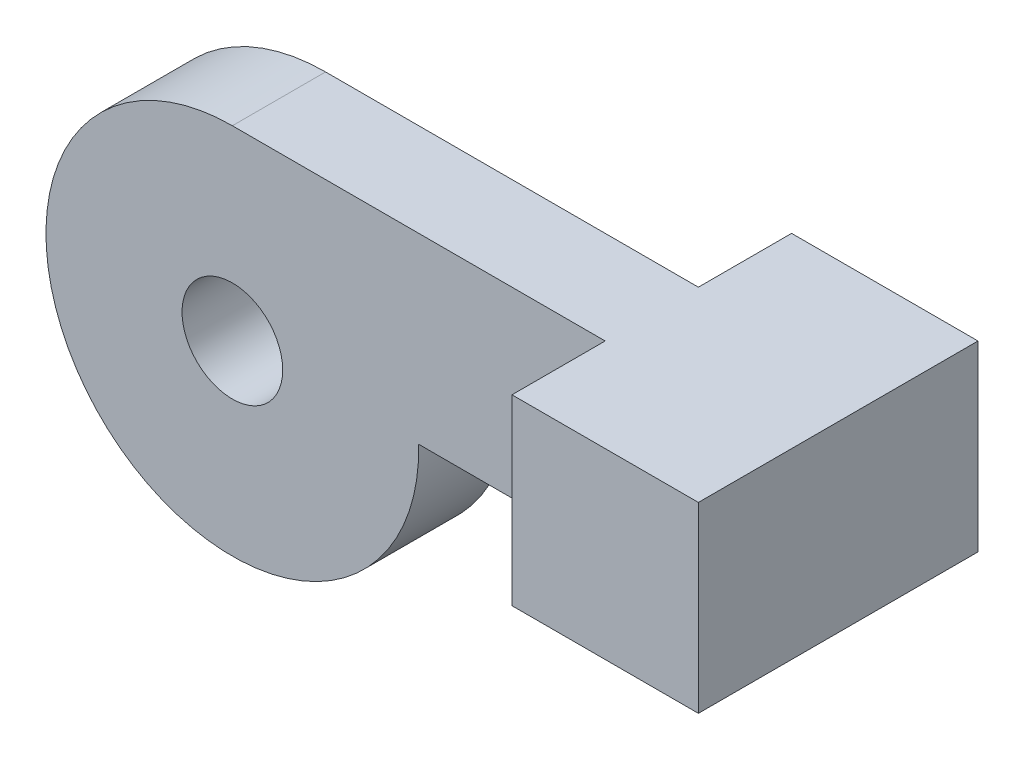
ISO-10303-21;
HEADER;
FILE_DESCRIPTION(('STEP AP214'),'2;1');
FILE_NAME('part.step','',(''),(''),'','','');
FILE_SCHEMA(('AUTOMOTIVE_DESIGN { 1 0 10303 214 1 1 1 1 }'));
ENDSEC;
DATA;
#1=APPLICATION_CONTEXT('core data for automotive mechanical design processes');
#2=APPLICATION_PROTOCOL_DEFINITION('international standard','automotive_design',2000,#1);
#3=PRODUCT_CONTEXT('',#1,'mechanical');
#4=PRODUCT('Part','Part','',(#3));
#5=PRODUCT_RELATED_PRODUCT_CATEGORY('part','',(#4));
#6=PRODUCT_DEFINITION_FORMATION('','',#4);
#7=PRODUCT_DEFINITION_CONTEXT('part definition',#1,'design');
#8=PRODUCT_DEFINITION('design','',#6,#7);
#9=PRODUCT_DEFINITION_SHAPE('','',#8);
#10=(LENGTH_UNIT() NAMED_UNIT(*) SI_UNIT(.MILLI.,.METRE.));
#11=(NAMED_UNIT(*) PLANE_ANGLE_UNIT() SI_UNIT($,.RADIAN.));
#12=(NAMED_UNIT(*) SI_UNIT($,.STERADIAN.) SOLID_ANGLE_UNIT());
#13=UNCERTAINTY_MEASURE_WITH_UNIT(LENGTH_MEASURE(1.E-05),#10,'distance_accuracy_value','');
#14=(GEOMETRIC_REPRESENTATION_CONTEXT(3) GLOBAL_UNCERTAINTY_ASSIGNED_CONTEXT((#13)) GLOBAL_UNIT_ASSIGNED_CONTEXT((#10,
#11,#12)) REPRESENTATION_CONTEXT('',''));
#15=CARTESIAN_POINT('',(0.,0.,0.));
#16=DIRECTION('',(0.,0.,1.));
#17=DIRECTION('',(1.,0.,0.));
#18=AXIS2_PLACEMENT_3D('',#15,#16,#17);
#19=CARTESIAN_POINT('',(0.,0.,3.175));
#20=DIRECTION('',(0.,0.,1.));
#21=DIRECTION('',(1.,0.,0.));
#22=AXIS2_PLACEMENT_3D('',#19,#20,#21);
#23=PLANE('',#22);
#24=CARTESIAN_POINT('',(0.,0.,3.175));
#25=DIRECTION('',(0.,0.,1.));
#26=DIRECTION('',(1.,0.,0.));
#27=AXIS2_PLACEMENT_3D('',#24,#25,#26);
#28=CIRCLE('',#27,3.429);
#29=CARTESIAN_POINT('',(3.429,0.,3.175));
#30=VERTEX_POINT('',#29);
#31=EDGE_CURVE('E143',#30,#30,#28,.T.);
#32=ORIENTED_EDGE('',*,*,#31,.F.);
#33=EDGE_LOOP('',(#32));
#34=FACE_BOUND('',#33,.T.);
#35=DIRECTION('',(1.,0.,0.));
#36=VECTOR('',#35,1.);
#37=CARTESIAN_POINT('',(38.1,0.254000000000005,3.175));
#38=LINE('',#37,#36);
#39=CARTESIAN_POINT('',(12.6974597459492,0.254000000000004,3.175));
#40=VERTEX_POINT('',#39);
#41=CARTESIAN_POINT('',(25.4,0.254000000000003,3.175));
#42=VERTEX_POINT('',#41);
#43=EDGE_CURVE('E57',#40,#42,#38,.T.);
#44=ORIENTED_EDGE('',*,*,#43,.T.);
#45=DIRECTION('',(0.,1.,0.));
#46=VECTOR('',#45,1.);
#47=CARTESIAN_POINT('',(25.4,0.,3.175));
#48=LINE('',#47,#46);
#49=CARTESIAN_POINT('',(25.4,12.7,3.175));
#50=VERTEX_POINT('',#49);
#51=EDGE_CURVE('E52',#42,#50,#48,.T.);
#52=ORIENTED_EDGE('',*,*,#51,.T.);
#53=DIRECTION('',(-1.,0.,0.));
#54=VECTOR('',#53,1.);
#55=CARTESIAN_POINT('',(0.,12.7,3.175));
#56=LINE('',#55,#54);
#57=CARTESIAN_POINT('',(0.,12.7,3.175));
#58=VERTEX_POINT('',#57);
#59=EDGE_CURVE('E149',#50,#58,#56,.T.);
#60=ORIENTED_EDGE('',*,*,#59,.T.);
#61=CARTESIAN_POINT('',(0.,0.,3.175));
#62=DIRECTION('',(0.,0.,1.));
#63=DIRECTION('',(1.,0.,0.));
#64=AXIS2_PLACEMENT_3D('',#61,#62,#63);
#65=CIRCLE('',#64,12.7);
#66=EDGE_CURVE('E151',#58,#40,#65,.T.);
#67=ORIENTED_EDGE('',*,*,#66,.T.);
#68=EDGE_LOOP('',(#44,#52,#60,#67));
#69=FACE_BOUND('',#68,.T.);
#70=ADVANCED_FACE('F37',(#34,#69),#23,.T.);
#71=CARTESIAN_POINT('',(0.,0.,-3.175));
#72=DIRECTION('',(0.,0.,1.));
#73=DIRECTION('',(1.,0.,0.));
#74=AXIS2_PLACEMENT_3D('',#71,#72,#73);
#75=PLANE('',#74);
#76=CARTESIAN_POINT('',(0.,0.,-3.175));
#77=DIRECTION('',(0.,0.,1.));
#78=DIRECTION('',(1.,0.,0.));
#79=AXIS2_PLACEMENT_3D('',#76,#77,#78);
#80=CIRCLE('',#79,3.429);
#81=CARTESIAN_POINT('',(3.429,0.,-3.175));
#82=VERTEX_POINT('',#81);
#83=EDGE_CURVE('E142',#82,#82,#80,.T.);
#84=ORIENTED_EDGE('',*,*,#83,.T.);
#85=EDGE_LOOP('',(#84));
#86=FACE_BOUND('',#85,.T.);
#87=DIRECTION('',(0.,1.,0.));
#88=VECTOR('',#87,1.);
#89=CARTESIAN_POINT('',(25.4,0.,-3.175));
#90=LINE('',#89,#88);
#91=CARTESIAN_POINT('',(25.4,0.254,-3.175));
#92=VERTEX_POINT('',#91);
#93=CARTESIAN_POINT('',(25.4,12.7,-3.175));
#94=VERTEX_POINT('',#93);
#95=EDGE_CURVE('E139',#92,#94,#90,.T.);
#96=ORIENTED_EDGE('',*,*,#95,.F.);
#97=DIRECTION('',(1.,0.,0.));
#98=VECTOR('',#97,1.);
#99=CARTESIAN_POINT('',(38.1,0.254000000000005,-3.175));
#100=LINE('',#99,#98);
#101=CARTESIAN_POINT('',(12.6974597459492,0.254000000000004,-3.175));
#102=VERTEX_POINT('',#101);
#103=EDGE_CURVE('E152',#102,#92,#100,.T.);
#104=ORIENTED_EDGE('',*,*,#103,.F.);
#105=CARTESIAN_POINT('',(0.,0.,-3.175));
#106=DIRECTION('',(0.,0.,1.));
#107=DIRECTION('',(1.,0.,0.));
#108=AXIS2_PLACEMENT_3D('',#105,#106,#107);
#109=CIRCLE('',#108,12.7);
#110=CARTESIAN_POINT('',(0.,12.7,-3.175));
#111=VERTEX_POINT('',#110);
#112=EDGE_CURVE('E157',#111,#102,#109,.T.);
#113=ORIENTED_EDGE('',*,*,#112,.F.);
#114=DIRECTION('',(-1.,0.,0.));
#115=VECTOR('',#114,1.);
#116=CARTESIAN_POINT('',(0.,12.7,-3.175));
#117=LINE('',#116,#115);
#118=EDGE_CURVE('E146',#94,#111,#117,.T.);
#119=ORIENTED_EDGE('',*,*,#118,.F.);
#120=EDGE_LOOP('',(#96,#104,#113,#119));
#121=FACE_BOUND('',#120,.T.);
#122=ADVANCED_FACE('F175',(#86,#121),#75,.F.);
#123=CARTESIAN_POINT('',(38.1,12.7,3.175));
#124=DIRECTION('',(-1.,0.,0.));
#125=DIRECTION('',(0.,0.,1.));
#126=AXIS2_PLACEMENT_3D('',#123,#124,#125);
#127=PLANE('',#126);
#128=DIRECTION('',(0.,0.,-1.));
#129=VECTOR('',#128,1.);
#130=CARTESIAN_POINT('',(38.1,0.254000000000005,3.175));
#131=LINE('',#130,#129);
#132=CARTESIAN_POINT('',(38.1,0.254000000000002,9.525));
#133=VERTEX_POINT('',#132);
#134=CARTESIAN_POINT('',(38.1,0.254000000000002,-9.525));
#135=VERTEX_POINT('',#134);
#136=EDGE_CURVE('E155',#133,#135,#131,.T.);
#137=ORIENTED_EDGE('',*,*,#136,.T.);
#138=DIRECTION('',(0.,1.,0.));
#139=VECTOR('',#138,1.);
#140=CARTESIAN_POINT('',(38.1,12.7,-9.525));
#141=LINE('',#140,#139);
#142=CARTESIAN_POINT('',(38.1,12.7,-9.525));
#143=VERTEX_POINT('',#142);
#144=EDGE_CURVE('E103',#135,#143,#141,.T.);
#145=ORIENTED_EDGE('',*,*,#144,.T.);
#146=DIRECTION('',(0.,0.,-1.));
#147=VECTOR('',#146,1.);
#148=CARTESIAN_POINT('',(38.1,12.7,3.175));
#149=LINE('',#148,#147);
#150=CARTESIAN_POINT('',(38.1,12.7,9.525));
#151=VERTEX_POINT('',#150);
#152=EDGE_CURVE('E11',#151,#143,#149,.T.);
#153=ORIENTED_EDGE('',*,*,#152,.F.);
#154=DIRECTION('',(0.,1.,0.));
#155=VECTOR('',#154,1.);
#156=CARTESIAN_POINT('',(38.1,12.7,9.525));
#157=LINE('',#156,#155);
#158=EDGE_CURVE('E101',#133,#151,#157,.T.);
#159=ORIENTED_EDGE('',*,*,#158,.F.);
#160=EDGE_LOOP('',(#137,#145,#153,#159));
#161=FACE_BOUND('',#160,.T.);
#162=ADVANCED_FACE('F39',(#161),#127,.F.);
#163=CARTESIAN_POINT('',(0.,12.7,3.175));
#164=DIRECTION('',(0.,-1.,0.));
#165=DIRECTION('',(0.,0.,-1.));
#166=AXIS2_PLACEMENT_3D('',#163,#164,#165);
#167=PLANE('',#166);
#168=ORIENTED_EDGE('',*,*,#152,.T.);
#169=DIRECTION('',(-1.,0.,0.));
#170=VECTOR('',#169,1.);
#171=CARTESIAN_POINT('',(38.1,12.7,-9.525));
#172=LINE('',#171,#170);
#173=CARTESIAN_POINT('',(25.4,12.7,-9.525));
#174=VERTEX_POINT('',#173);
#175=EDGE_CURVE('E130',#143,#174,#172,.T.);
#176=ORIENTED_EDGE('',*,*,#175,.T.);
#177=DIRECTION('',(0.,0.,-1.));
#178=VECTOR('',#177,1.);
#179=CARTESIAN_POINT('',(25.4,12.7,9.525));
#180=LINE('',#179,#178);
#181=EDGE_CURVE('E137',#94,#174,#180,.T.);
#182=ORIENTED_EDGE('',*,*,#181,.F.);
#183=ORIENTED_EDGE('',*,*,#118,.T.);
#184=DIRECTION('',(0.,0.,-1.));
#185=VECTOR('',#184,1.);
#186=CARTESIAN_POINT('',(0.,12.7,3.175));
#187=LINE('',#186,#185);
#188=EDGE_CURVE('E45',#58,#111,#187,.T.);
#189=ORIENTED_EDGE('',*,*,#188,.F.);
#190=ORIENTED_EDGE('',*,*,#59,.F.);
#191=CARTESIAN_POINT('',(25.4,12.7,9.525));
#192=VERTEX_POINT('',#191);
#193=EDGE_CURVE('E111',#192,#50,#180,.T.);
#194=ORIENTED_EDGE('',*,*,#193,.F.);
#195=DIRECTION('',(-1.,0.,0.));
#196=VECTOR('',#195,1.);
#197=CARTESIAN_POINT('',(38.1,12.7,9.525));
#198=LINE('',#197,#196);
#199=EDGE_CURVE('E108',#151,#192,#198,.T.);
#200=ORIENTED_EDGE('',*,*,#199,.F.);
#201=EDGE_LOOP('',(#168,#176,#182,#183,#189,#190,#194,#200));
#202=FACE_BOUND('',#201,.T.);
#203=ADVANCED_FACE('F109',(#202),#167,.F.);
#204=CARTESIAN_POINT('',(0.,0.,3.175));
#205=DIRECTION('',(0.,0.,-1.));
#206=DIRECTION('',(-1.,0.,0.));
#207=AXIS2_PLACEMENT_3D('',#204,#205,#206);
#208=CYLINDRICAL_SURFACE('',#207,12.7);
#209=ORIENTED_EDGE('',*,*,#112,.T.);
#210=DIRECTION('',(0.,0.,-1.));
#211=VECTOR('',#210,1.);
#212=CARTESIAN_POINT('',(12.6974597459492,0.254000000000004,3.175));
#213=LINE('',#212,#211);
#214=EDGE_CURVE('E162',#40,#102,#213,.T.);
#215=ORIENTED_EDGE('',*,*,#214,.F.);
#216=ORIENTED_EDGE('',*,*,#66,.F.);
#217=ORIENTED_EDGE('',*,*,#188,.T.);
#218=EDGE_LOOP('',(#209,#215,#216,#217));
#219=FACE_BOUND('',#218,.T.);
#220=ADVANCED_FACE('F169',(#219),#208,.T.);
#221=CARTESIAN_POINT('',(38.1,0.254000000000005,3.175));
#222=DIRECTION('',(0.,1.,0.));
#223=DIRECTION('',(-1.,0.,0.));
#224=AXIS2_PLACEMENT_3D('',#221,#222,#223);
#225=PLANE('',#224);
#226=ORIENTED_EDGE('',*,*,#136,.F.);
#227=DIRECTION('',(1.,0.,0.));
#228=VECTOR('',#227,1.);
#229=CARTESIAN_POINT('',(38.1,0.254000000000002,9.525));
#230=LINE('',#229,#228);
#231=CARTESIAN_POINT('',(25.4,0.254,9.525));
#232=VERTEX_POINT('',#231);
#233=EDGE_CURVE('E119',#232,#133,#230,.T.);
#234=ORIENTED_EDGE('',*,*,#233,.F.);
#235=DIRECTION('',(0.,0.,-1.));
#236=VECTOR('',#235,1.);
#237=CARTESIAN_POINT('',(25.4,0.254,9.525));
#238=LINE('',#237,#236);
#239=EDGE_CURVE('E134',#232,#42,#238,.T.);
#240=ORIENTED_EDGE('',*,*,#239,.T.);
#241=ORIENTED_EDGE('',*,*,#43,.F.);
#242=ORIENTED_EDGE('',*,*,#214,.T.);
#243=ORIENTED_EDGE('',*,*,#103,.T.);
#244=CARTESIAN_POINT('',(25.4,0.254,-9.525));
#245=VERTEX_POINT('',#244);
#246=EDGE_CURVE('E128',#92,#245,#238,.T.);
#247=ORIENTED_EDGE('',*,*,#246,.T.);
#248=DIRECTION('',(1.,0.,0.));
#249=VECTOR('',#248,1.);
#250=CARTESIAN_POINT('',(38.1,0.254000000000002,-9.525));
#251=LINE('',#250,#249);
#252=EDGE_CURVE('E120',#245,#135,#251,.T.);
#253=ORIENTED_EDGE('',*,*,#252,.T.);
#254=EDGE_LOOP('',(#226,#234,#240,#241,#242,#243,#247,#253));
#255=FACE_BOUND('',#254,.T.);
#256=ADVANCED_FACE('F177',(#255),#225,.F.);
#257=CARTESIAN_POINT('',(0.,0.,3.175));
#258=DIRECTION('',(0.,0.,-1.));
#259=DIRECTION('',(-1.,0.,0.));
#260=AXIS2_PLACEMENT_3D('',#257,#258,#259);
#261=CYLINDRICAL_SURFACE('',#260,3.429);
#262=ORIENTED_EDGE('',*,*,#31,.T.);
#263=EDGE_LOOP('',(#262));
#264=FACE_BOUND('',#263,.T.);
#265=ORIENTED_EDGE('',*,*,#83,.F.);
#266=EDGE_LOOP('',(#265));
#267=FACE_BOUND('',#266,.T.);
#268=ADVANCED_FACE('F202',(#264,#267),#261,.F.);
#269=CARTESIAN_POINT('',(0.,0.,-9.525));
#270=DIRECTION('',(0.,0.,-1.));
#271=DIRECTION('',(-1.,0.,0.));
#272=AXIS2_PLACEMENT_3D('',#269,#270,#271);
#273=PLANE('',#272);
#274=ORIENTED_EDGE('',*,*,#144,.F.);
#275=ORIENTED_EDGE('',*,*,#252,.F.);
#276=DIRECTION('',(0.,-1.,0.));
#277=VECTOR('',#276,1.);
#278=CARTESIAN_POINT('',(25.4,12.7,-9.525));
#279=LINE('',#278,#277);
#280=EDGE_CURVE('E123',#174,#245,#279,.T.);
#281=ORIENTED_EDGE('',*,*,#280,.F.);
#282=ORIENTED_EDGE('',*,*,#175,.F.);
#283=EDGE_LOOP('',(#274,#275,#281,#282));
#284=FACE_BOUND('',#283,.T.);
#285=ADVANCED_FACE('F189',(#284),#273,.T.);
#286=CARTESIAN_POINT('',(25.4,12.7,9.525));
#287=DIRECTION('',(1.,0.,0.));
#288=DIRECTION('',(0.,1.,0.));
#289=AXIS2_PLACEMENT_3D('',#286,#287,#288);
#290=PLANE('',#289);
#291=ORIENTED_EDGE('',*,*,#246,.F.);
#292=ORIENTED_EDGE('',*,*,#95,.T.);
#293=ORIENTED_EDGE('',*,*,#181,.T.);
#294=ORIENTED_EDGE('',*,*,#280,.T.);
#295=EDGE_LOOP('',(#291,#292,#293,#294));
#296=FACE_BOUND('',#295,.T.);
#297=ADVANCED_FACE('F182',(#296),#290,.F.);
#298=ORIENTED_EDGE('',*,*,#51,.F.);
#299=ORIENTED_EDGE('',*,*,#239,.F.);
#300=DIRECTION('',(0.,-1.,0.));
#301=VECTOR('',#300,1.);
#302=CARTESIAN_POINT('',(25.4,12.7,9.525));
#303=LINE('',#302,#301);
#304=EDGE_CURVE('E114',#192,#232,#303,.T.);
#305=ORIENTED_EDGE('',*,*,#304,.F.);
#306=ORIENTED_EDGE('',*,*,#193,.T.);
#307=EDGE_LOOP('',(#298,#299,#305,#306));
#308=FACE_BOUND('',#307,.T.);
#309=ADVANCED_FACE('F180',(#308),#290,.F.);
#310=CARTESIAN_POINT('',(0.,0.,9.525));
#311=DIRECTION('',(0.,0.,-1.));
#312=DIRECTION('',(-1.,0.,0.));
#313=AXIS2_PLACEMENT_3D('',#310,#311,#312);
#314=PLANE('',#313);
#315=ORIENTED_EDGE('',*,*,#158,.T.);
#316=ORIENTED_EDGE('',*,*,#199,.T.);
#317=ORIENTED_EDGE('',*,*,#304,.T.);
#318=ORIENTED_EDGE('',*,*,#233,.T.);
#319=EDGE_LOOP('',(#315,#316,#317,#318));
#320=FACE_BOUND('',#319,.T.);
#321=ADVANCED_FACE('F117',(#320),#314,.F.);
#322=CLOSED_SHELL('',(#70,#122,#162,#203,#220,#256,#268,#285,#297,#309,#321));
#323=MANIFOLD_SOLID_BREP('B2',#322);
#324=ADVANCED_BREP_SHAPE_REPRESENTATION('',(#18,#323),#14);
#325=SHAPE_DEFINITION_REPRESENTATION(#9,#324);
ENDSEC;
END-ISO-10303-21;
